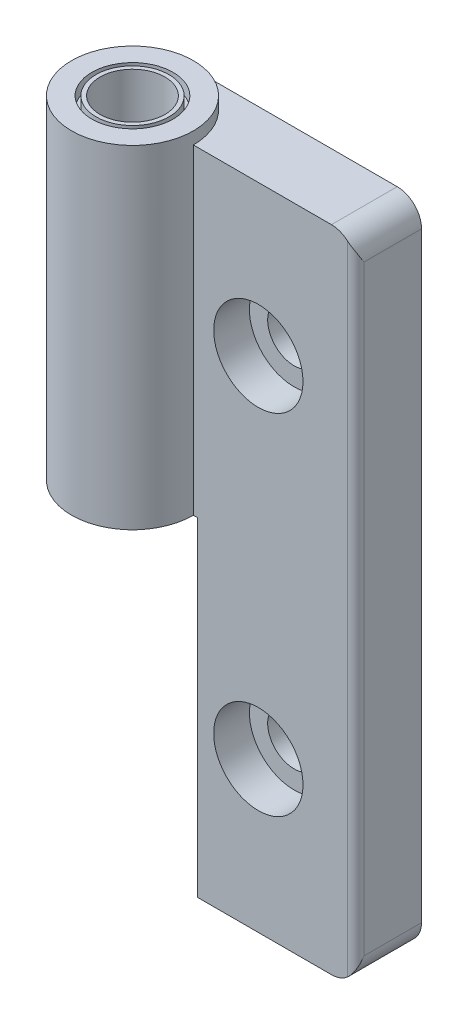
ISO-10303-21;
HEADER;
FILE_DESCRIPTION(('STEP AP214'),'2;1');
FILE_NAME('part.step','',(''),(''),'','','');
FILE_SCHEMA(('AUTOMOTIVE_DESIGN { 1 0 10303 214 1 1 1 1 }'));
ENDSEC;
DATA;
#1=APPLICATION_CONTEXT('core data for automotive mechanical design processes');
#2=APPLICATION_PROTOCOL_DEFINITION('international standard','automotive_design',2000,#1);
#3=PRODUCT_CONTEXT('',#1,'mechanical');
#4=PRODUCT('Part','Part','',(#3));
#5=PRODUCT_RELATED_PRODUCT_CATEGORY('part','',(#4));
#6=PRODUCT_DEFINITION_FORMATION('','',#4);
#7=PRODUCT_DEFINITION_CONTEXT('part definition',#1,'design');
#8=PRODUCT_DEFINITION('design','',#6,#7);
#9=PRODUCT_DEFINITION_SHAPE('','',#8);
#10=(LENGTH_UNIT() NAMED_UNIT(*) SI_UNIT(.MILLI.,.METRE.));
#11=(NAMED_UNIT(*) PLANE_ANGLE_UNIT() SI_UNIT($,.RADIAN.));
#12=(NAMED_UNIT(*) SI_UNIT($,.STERADIAN.) SOLID_ANGLE_UNIT());
#13=UNCERTAINTY_MEASURE_WITH_UNIT(LENGTH_MEASURE(1.E-05),#10,'distance_accuracy_value','');
#14=(GEOMETRIC_REPRESENTATION_CONTEXT(3) GLOBAL_UNCERTAINTY_ASSIGNED_CONTEXT((#13)) GLOBAL_UNIT_ASSIGNED_CONTEXT((#10,
#11,#12)) REPRESENTATION_CONTEXT('',''));
#15=CARTESIAN_POINT('',(0.,0.,0.));
#16=DIRECTION('',(0.,0.,1.));
#17=DIRECTION('',(1.,0.,0.));
#18=AXIS2_PLACEMENT_3D('',#15,#16,#17);
#19=CARTESIAN_POINT('',(0.,0.499999999999994,0.));
#20=DIRECTION('',(0.,1.,0.));
#21=DIRECTION('',(0.,0.,1.));
#22=AXIS2_PLACEMENT_3D('',#19,#20,#21);
#23=PLANE('',#22);
#24=CARTESIAN_POINT('',(0.,0.499999999999994,0.));
#25=DIRECTION('',(0.,1.,0.));
#26=DIRECTION('',(0.,0.,1.));
#27=AXIS2_PLACEMENT_3D('',#24,#25,#26);
#28=CIRCLE('',#27,3.99999999999998);
#29=CARTESIAN_POINT('',(0.,0.499999999999994,3.99999999999998));
#30=VERTEX_POINT('',#29);
#31=EDGE_CURVE('E371',#30,#30,#28,.T.);
#32=ORIENTED_EDGE('',*,*,#31,.T.);
#33=EDGE_LOOP('',(#32));
#34=FACE_BOUND('',#33,.T.);
#35=DIRECTION('',(0.,0.,-1.));
#36=VECTOR('',#35,1.);
#37=CARTESIAN_POINT('',(8.,0.499999999999994,-8.1));
#38=LINE('',#37,#36);
#39=CARTESIAN_POINT('',(8.,0.499999999999994,0.));
#40=VERTEX_POINT('',#39);
#41=CARTESIAN_POINT('',(8.,0.499999999999994,-8.1));
#42=VERTEX_POINT('',#41);
#43=EDGE_CURVE('E143',#40,#42,#38,.T.);
#44=ORIENTED_EDGE('',*,*,#43,.F.);
#45=DIRECTION('',(1.,0.,0.));
#46=VECTOR('',#45,1.);
#47=CARTESIAN_POINT('',(7.5,0.499999999999994,0.));
#48=LINE('',#47,#46);
#49=CARTESIAN_POINT('',(7.5,0.499999999999994,0.));
#50=VERTEX_POINT('',#49);
#51=EDGE_CURVE('E266',#50,#40,#48,.T.);
#52=ORIENTED_EDGE('',*,*,#51,.F.);
#53=CARTESIAN_POINT('',(0.,0.499999999999994,0.));
#54=DIRECTION('',(0.,1.,0.));
#55=DIRECTION('',(0.,0.,1.));
#56=AXIS2_PLACEMENT_3D('',#53,#54,#55);
#57=CIRCLE('',#56,7.5);
#58=CARTESIAN_POINT('',(2.,0.499999999999994,-7.22841614740048));
#59=VERTEX_POINT('',#58);
#60=EDGE_CURVE('E131',#59,#50,#57,.T.);
#61=ORIENTED_EDGE('',*,*,#60,.F.);
#62=DIRECTION('',(0.,0.,1.));
#63=VECTOR('',#62,1.);
#64=CARTESIAN_POINT('',(2.,0.499999999999994,-8.1));
#65=LINE('',#64,#63);
#66=CARTESIAN_POINT('',(2.,0.499999999999994,-8.1));
#67=VERTEX_POINT('',#66);
#68=EDGE_CURVE('E270',#67,#59,#65,.T.);
#69=ORIENTED_EDGE('',*,*,#68,.F.);
#70=DIRECTION('',(-1.,0.,0.));
#71=VECTOR('',#70,1.);
#72=CARTESIAN_POINT('',(27.5,0.499999999999994,-8.1));
#73=LINE('',#72,#71);
#74=EDGE_CURVE('E122',#42,#67,#73,.T.);
#75=ORIENTED_EDGE('',*,*,#74,.F.);
#76=EDGE_LOOP('',(#44,#52,#61,#69,#75));
#77=FACE_BOUND('',#76,.T.);
#78=ADVANCED_FACE('F32',(#34,#77),#23,.F.);
#79=CARTESIAN_POINT('',(27.5,0.499999999999994,0.));
#80=DIRECTION('',(1.,0.,0.));
#81=DIRECTION('',(0.,0.,-1.));
#82=AXIS2_PLACEMENT_3D('',#79,#80,#81);
#83=PLANE('',#82);
#84=DIRECTION('',(0.,1.,0.));
#85=VECTOR('',#84,1.);
#86=CARTESIAN_POINT('',(27.5,0.499999999999994,-8.1));
#87=LINE('',#86,#85);
#88=CARTESIAN_POINT('',(27.5,-37.,-8.1));
#89=VERTEX_POINT('',#88);
#90=CARTESIAN_POINT('',(27.5,37.,-8.1));
#91=VERTEX_POINT('',#90);
#92=EDGE_CURVE('E264',#89,#91,#87,.T.);
#93=ORIENTED_EDGE('',*,*,#92,.T.);
#94=DIRECTION('',(0.,0.,-1.));
#95=VECTOR('',#94,1.);
#96=CARTESIAN_POINT('',(27.5,37.,0.));
#97=LINE('',#96,#95);
#98=CARTESIAN_POINT('',(27.5,37.,-1.));
#99=VERTEX_POINT('',#98);
#100=EDGE_CURVE('E191',#91,#99,#97,.F.);
#101=ORIENTED_EDGE('',*,*,#100,.T.);
#102=DIRECTION('',(0.,1.,0.));
#103=VECTOR('',#102,1.);
#104=CARTESIAN_POINT('',(27.5,0.499999999999994,-1.));
#105=LINE('',#104,#103);
#106=CARTESIAN_POINT('',(27.5,-37.,-1.));
#107=VERTEX_POINT('',#106);
#108=EDGE_CURVE('E180',#99,#107,#105,.F.);
#109=ORIENTED_EDGE('',*,*,#108,.T.);
#110=DIRECTION('',(0.,0.,1.));
#111=VECTOR('',#110,1.);
#112=CARTESIAN_POINT('',(27.5,-37.,-8.1));
#113=LINE('',#112,#111);
#114=EDGE_CURVE('E189',#107,#89,#113,.F.);
#115=ORIENTED_EDGE('',*,*,#114,.T.);
#116=EDGE_LOOP('',(#93,#101,#109,#115));
#117=FACE_BOUND('',#116,.T.);
#118=ADVANCED_FACE('F209',(#117),#83,.T.);
#119=CARTESIAN_POINT('',(7.5,0.499999999999994,0.));
#120=DIRECTION('',(0.,0.,1.));
#121=DIRECTION('',(1.,0.,0.));
#122=AXIS2_PLACEMENT_3D('',#119,#120,#121);
#123=PLANE('',#122);
#124=CARTESIAN_POINT('',(15.5,21.5,0.));
#125=DIRECTION('',(0.,0.,1.));
#126=DIRECTION('',(1.,0.,0.));
#127=AXIS2_PLACEMENT_3D('',#124,#125,#126);
#128=CIRCLE('',#127,5.49999999999999);
#129=CARTESIAN_POINT('',(21.,21.5,0.));
#130=VERTEX_POINT('',#129);
#131=EDGE_CURVE('E356',#130,#130,#128,.T.);
#132=ORIENTED_EDGE('',*,*,#131,.F.);
#133=EDGE_LOOP('',(#132));
#134=FACE_BOUND('',#133,.T.);
#135=CARTESIAN_POINT('',(15.5,-21.5,0.));
#136=DIRECTION('',(0.,0.,1.));
#137=DIRECTION('',(1.,0.,0.));
#138=AXIS2_PLACEMENT_3D('',#135,#136,#137);
#139=CIRCLE('',#138,5.49999999999999);
#140=CARTESIAN_POINT('',(21.,-21.5,0.));
#141=VERTEX_POINT('',#140);
#142=EDGE_CURVE('E177',#141,#141,#139,.T.);
#143=ORIENTED_EDGE('',*,*,#142,.F.);
#144=EDGE_LOOP('',(#143));
#145=FACE_BOUND('',#144,.T.);
#146=DIRECTION('',(0.,1.,0.));
#147=VECTOR('',#146,1.);
#148=CARTESIAN_POINT('',(26.5,0.499999999999994,0.));
#149=LINE('',#148,#147);
#150=CARTESIAN_POINT('',(26.5,-39.2360679774998,0.));
#151=VERTEX_POINT('',#150);
#152=CARTESIAN_POINT('',(26.5,39.2360679774998,0.));
#153=VERTEX_POINT('',#152);
#154=EDGE_CURVE('E133',#151,#153,#149,.T.);
#155=ORIENTED_EDGE('',*,*,#154,.T.);
#156=CARTESIAN_POINT('',(24.5,37.,0.));
#157=DIRECTION('',(0.,0.,1.));
#158=DIRECTION('',(1.,0.,0.));
#159=AXIS2_PLACEMENT_3D('',#156,#157,#158);
#160=CIRCLE('',#159,2.99999999999999);
#161=CARTESIAN_POINT('',(24.5,40.,0.));
#162=VERTEX_POINT('',#161);
#163=EDGE_CURVE('E41',#153,#162,#160,.T.);
#164=ORIENTED_EDGE('',*,*,#163,.T.);
#165=DIRECTION('',(1.,0.,0.));
#166=VECTOR('',#165,1.);
#167=CARTESIAN_POINT('',(7.5,40.,0.));
#168=LINE('',#167,#166);
#169=CARTESIAN_POINT('',(7.5,40.,0.));
#170=VERTEX_POINT('',#169);
#171=EDGE_CURVE('E111',#170,#162,#168,.T.);
#172=ORIENTED_EDGE('',*,*,#171,.F.);
#173=DIRECTION('',(0.,1.,0.));
#174=VECTOR('',#173,1.);
#175=CARTESIAN_POINT('',(7.5,0.499999999999994,0.));
#176=LINE('',#175,#174);
#177=EDGE_CURVE('E115',#50,#170,#176,.T.);
#178=ORIENTED_EDGE('',*,*,#177,.F.);
#179=ORIENTED_EDGE('',*,*,#51,.T.);
#180=DIRECTION('',(0.,1.,0.));
#181=VECTOR('',#180,1.);
#182=CARTESIAN_POINT('',(8.,-40.,0.));
#183=LINE('',#182,#181);
#184=CARTESIAN_POINT('',(8.,-40.,0.));
#185=VERTEX_POINT('',#184);
#186=EDGE_CURVE('E255',#185,#40,#183,.T.);
#187=ORIENTED_EDGE('',*,*,#186,.F.);
#188=DIRECTION('',(-1.,0.,0.));
#189=VECTOR('',#188,1.);
#190=CARTESIAN_POINT('',(8.,-40.,0.));
#191=LINE('',#190,#189);
#192=CARTESIAN_POINT('',(24.5,-40.,0.));
#193=VERTEX_POINT('',#192);
#194=EDGE_CURVE('E150',#193,#185,#191,.T.);
#195=ORIENTED_EDGE('',*,*,#194,.F.);
#196=CARTESIAN_POINT('',(24.5,-37.,0.));
#197=DIRECTION('',(0.,0.,1.));
#198=DIRECTION('',(1.,0.,0.));
#199=AXIS2_PLACEMENT_3D('',#196,#197,#198);
#200=CIRCLE('',#199,2.99999999999999);
#201=EDGE_CURVE('E48',#193,#151,#200,.T.);
#202=ORIENTED_EDGE('',*,*,#201,.T.);
#203=EDGE_LOOP('',(#155,#164,#172,#178,#179,#187,#195,#202));
#204=FACE_BOUND('',#203,.T.);
#205=ADVANCED_FACE('F113',(#134,#145,#204),#123,.T.);
#206=CARTESIAN_POINT('',(0.,0.499999999999994,0.));
#207=DIRECTION('',(0.,1.,0.));
#208=DIRECTION('',(0.,0.,1.));
#209=AXIS2_PLACEMENT_3D('',#206,#207,#208);
#210=CYLINDRICAL_SURFACE('',#209,7.5);
#211=ORIENTED_EDGE('',*,*,#177,.T.);
#212=CARTESIAN_POINT('',(0.,40.,0.));
#213=DIRECTION('',(0.,1.,0.));
#214=DIRECTION('',(0.,0.,1.));
#215=AXIS2_PLACEMENT_3D('',#212,#213,#214);
#216=CIRCLE('',#215,7.5);
#217=CARTESIAN_POINT('',(2.,40.,-7.22841614740048));
#218=VERTEX_POINT('',#217);
#219=EDGE_CURVE('E129',#170,#218,#216,.T.);
#220=ORIENTED_EDGE('',*,*,#219,.T.);
#221=DIRECTION('',(0.,1.,0.));
#222=VECTOR('',#221,1.);
#223=CARTESIAN_POINT('',(2.,0.499999999999994,-7.22841614740048));
#224=LINE('',#223,#222);
#225=EDGE_CURVE('E134',#59,#218,#224,.T.);
#226=ORIENTED_EDGE('',*,*,#225,.F.);
#227=ORIENTED_EDGE('',*,*,#60,.T.);
#228=EDGE_LOOP('',(#211,#220,#226,#227));
#229=FACE_BOUND('',#228,.T.);
#230=CARTESIAN_POINT('',(0.,41.5,0.));
#231=DIRECTION('',(0.,1.,0.));
#232=DIRECTION('',(0.,0.,1.));
#233=AXIS2_PLACEMENT_3D('',#230,#231,#232);
#234=CIRCLE('',#233,7.5);
#235=CARTESIAN_POINT('',(0.,41.5,7.5));
#236=VERTEX_POINT('',#235);
#237=EDGE_CURVE('E139',#236,#236,#234,.T.);
#238=ORIENTED_EDGE('',*,*,#237,.F.);
#239=EDGE_LOOP('',(#238));
#240=FACE_BOUND('',#239,.T.);
#241=ADVANCED_FACE('F127',(#229,#240),#210,.T.);
#242=CARTESIAN_POINT('',(2.,0.499999999999994,-8.1));
#243=DIRECTION('',(-1.,0.,0.));
#244=DIRECTION('',(0.,0.,1.));
#245=AXIS2_PLACEMENT_3D('',#242,#243,#244);
#246=PLANE('',#245);
#247=DIRECTION('',(0.,0.,1.));
#248=VECTOR('',#247,1.);
#249=CARTESIAN_POINT('',(2.,40.,-8.1));
#250=LINE('',#249,#248);
#251=CARTESIAN_POINT('',(2.,40.,-8.1));
#252=VERTEX_POINT('',#251);
#253=EDGE_CURVE('E123',#252,#218,#250,.T.);
#254=ORIENTED_EDGE('',*,*,#253,.F.);
#255=DIRECTION('',(0.,1.,0.));
#256=VECTOR('',#255,1.);
#257=CARTESIAN_POINT('',(2.,0.499999999999994,-8.1));
#258=LINE('',#257,#256);
#259=EDGE_CURVE('E162',#67,#252,#258,.T.);
#260=ORIENTED_EDGE('',*,*,#259,.F.);
#261=ORIENTED_EDGE('',*,*,#68,.T.);
#262=ORIENTED_EDGE('',*,*,#225,.T.);
#263=EDGE_LOOP('',(#254,#260,#261,#262));
#264=FACE_BOUND('',#263,.T.);
#265=ADVANCED_FACE('F239',(#264),#246,.T.);
#266=CARTESIAN_POINT('',(27.5,0.499999999999994,-8.1));
#267=DIRECTION('',(0.,0.,-1.));
#268=DIRECTION('',(-1.,0.,0.));
#269=AXIS2_PLACEMENT_3D('',#266,#267,#268);
#270=PLANE('',#269);
#271=CARTESIAN_POINT('',(15.5,21.5,-8.1));
#272=DIRECTION('',(0.,0.,-1.));
#273=DIRECTION('',(-1.,0.,0.));
#274=AXIS2_PLACEMENT_3D('',#271,#272,#273);
#275=CIRCLE('',#274,3.25000000000001);
#276=CARTESIAN_POINT('',(12.25,21.5,-8.1));
#277=VERTEX_POINT('',#276);
#278=EDGE_CURVE('E174',#277,#277,#275,.T.);
#279=ORIENTED_EDGE('',*,*,#278,.F.);
#280=EDGE_LOOP('',(#279));
#281=FACE_BOUND('',#280,.T.);
#282=CARTESIAN_POINT('',(15.5,-21.5,-8.1));
#283=DIRECTION('',(0.,0.,-1.));
#284=DIRECTION('',(-1.,0.,0.));
#285=AXIS2_PLACEMENT_3D('',#282,#283,#284);
#286=CIRCLE('',#285,3.25000000000001);
#287=CARTESIAN_POINT('',(12.25,-21.5,-8.1));
#288=VERTEX_POINT('',#287);
#289=EDGE_CURVE('E169',#288,#288,#286,.T.);
#290=ORIENTED_EDGE('',*,*,#289,.F.);
#291=EDGE_LOOP('',(#290));
#292=FACE_BOUND('',#291,.T.);
#293=DIRECTION('',(-1.,0.,0.));
#294=VECTOR('',#293,1.);
#295=CARTESIAN_POINT('',(27.5,40.,-8.1));
#296=LINE('',#295,#294);
#297=CARTESIAN_POINT('',(24.5,40.,-8.1));
#298=VERTEX_POINT('',#297);
#299=EDGE_CURVE('E166',#298,#252,#296,.T.);
#300=ORIENTED_EDGE('',*,*,#299,.F.);
#301=CARTESIAN_POINT('',(24.5,37.,-8.1));
#302=DIRECTION('',(0.,0.,-1.));
#303=DIRECTION('',(-1.,0.,0.));
#304=AXIS2_PLACEMENT_3D('',#301,#302,#303);
#305=CIRCLE('',#304,2.99999999999999);
#306=EDGE_CURVE('E187',#298,#91,#305,.T.);
#307=ORIENTED_EDGE('',*,*,#306,.T.);
#308=ORIENTED_EDGE('',*,*,#92,.F.);
#309=CARTESIAN_POINT('',(24.5,-37.,-8.1));
#310=DIRECTION('',(0.,0.,-1.));
#311=DIRECTION('',(-1.,0.,0.));
#312=AXIS2_PLACEMENT_3D('',#309,#310,#311);
#313=CIRCLE('',#312,2.99999999999999);
#314=CARTESIAN_POINT('',(24.5,-40.,-8.1));
#315=VERTEX_POINT('',#314);
#316=EDGE_CURVE('E185',#89,#315,#313,.T.);
#317=ORIENTED_EDGE('',*,*,#316,.T.);
#318=DIRECTION('',(1.,0.,0.));
#319=VECTOR('',#318,1.);
#320=CARTESIAN_POINT('',(27.5,-40.,-8.1));
#321=LINE('',#320,#319);
#322=CARTESIAN_POINT('',(8.,-40.,-8.1));
#323=VERTEX_POINT('',#322);
#324=EDGE_CURVE('E290',#323,#315,#321,.T.);
#325=ORIENTED_EDGE('',*,*,#324,.F.);
#326=DIRECTION('',(0.,1.,0.));
#327=VECTOR('',#326,1.);
#328=CARTESIAN_POINT('',(8.,-40.,-8.1));
#329=LINE('',#328,#327);
#330=EDGE_CURVE('E258',#323,#42,#329,.T.);
#331=ORIENTED_EDGE('',*,*,#330,.T.);
#332=ORIENTED_EDGE('',*,*,#74,.T.);
#333=ORIENTED_EDGE('',*,*,#259,.T.);
#334=EDGE_LOOP('',(#300,#307,#308,#317,#325,#331,#332,#333));
#335=FACE_BOUND('',#334,.T.);
#336=ADVANCED_FACE('F233',(#281,#292,#335),#270,.T.);
#337=CARTESIAN_POINT('',(0.,40.,0.));
#338=DIRECTION('',(0.,1.,0.));
#339=DIRECTION('',(0.,0.,1.));
#340=AXIS2_PLACEMENT_3D('',#337,#338,#339);
#341=PLANE('',#340);
#342=ORIENTED_EDGE('',*,*,#171,.T.);
#343=DIRECTION('',(0.,0.,-1.));
#344=VECTOR('',#343,1.);
#345=CARTESIAN_POINT('',(24.5,40.,0.));
#346=LINE('',#345,#344);
#347=EDGE_CURVE('E183',#162,#298,#346,.T.);
#348=ORIENTED_EDGE('',*,*,#347,.T.);
#349=ORIENTED_EDGE('',*,*,#299,.T.);
#350=ORIENTED_EDGE('',*,*,#253,.T.);
#351=ORIENTED_EDGE('',*,*,#219,.F.);
#352=EDGE_LOOP('',(#342,#348,#349,#350,#351));
#353=FACE_BOUND('',#352,.T.);
#354=ADVANCED_FACE('F137',(#353),#341,.T.);
#355=CARTESIAN_POINT('',(8.,-40.,-8.1));
#356=DIRECTION('',(1.,0.,0.));
#357=DIRECTION('',(0.,0.,-1.));
#358=AXIS2_PLACEMENT_3D('',#355,#356,#357);
#359=PLANE('',#358);
#360=ORIENTED_EDGE('',*,*,#43,.T.);
#361=ORIENTED_EDGE('',*,*,#330,.F.);
#362=DIRECTION('',(0.,0.,-1.));
#363=VECTOR('',#362,1.);
#364=CARTESIAN_POINT('',(8.,-40.,-8.1));
#365=LINE('',#364,#363);
#366=EDGE_CURVE('E286',#185,#323,#365,.T.);
#367=ORIENTED_EDGE('',*,*,#366,.F.);
#368=ORIENTED_EDGE('',*,*,#186,.T.);
#369=EDGE_LOOP('',(#360,#361,#367,#368));
#370=FACE_BOUND('',#369,.T.);
#371=ADVANCED_FACE('F229',(#370),#359,.F.);
#372=CARTESIAN_POINT('',(0.,-40.,0.));
#373=DIRECTION('',(0.,1.,0.));
#374=DIRECTION('',(0.,0.,1.));
#375=AXIS2_PLACEMENT_3D('',#372,#373,#374);
#376=PLANE('',#375);
#377=ORIENTED_EDGE('',*,*,#324,.T.);
#378=DIRECTION('',(0.,0.,1.));
#379=VECTOR('',#378,1.);
#380=CARTESIAN_POINT('',(24.5,-40.,-1.));
#381=LINE('',#380,#379);
#382=EDGE_CURVE('E11',#315,#193,#381,.T.);
#383=ORIENTED_EDGE('',*,*,#382,.T.);
#384=ORIENTED_EDGE('',*,*,#194,.T.);
#385=ORIENTED_EDGE('',*,*,#366,.T.);
#386=EDGE_LOOP('',(#377,#383,#384,#385));
#387=FACE_BOUND('',#386,.T.);
#388=ADVANCED_FACE('F291',(#387),#376,.F.);
#389=CARTESIAN_POINT('',(0.,41.5,0.));
#390=DIRECTION('',(0.,1.,0.));
#391=DIRECTION('',(0.,0.,1.));
#392=AXIS2_PLACEMENT_3D('',#389,#390,#391);
#393=PLANE('',#392);
#394=CARTESIAN_POINT('',(0.,41.5,0.));
#395=DIRECTION('',(0.,1.,0.));
#396=DIRECTION('',(0.,0.,1.));
#397=AXIS2_PLACEMENT_3D('',#394,#395,#396);
#398=CIRCLE('',#397,4.99999999999999);
#399=CARTESIAN_POINT('',(0.,41.5,4.99999999999999));
#400=VERTEX_POINT('',#399);
#401=EDGE_CURVE('E146',#400,#400,#398,.T.);
#402=ORIENTED_EDGE('',*,*,#401,.F.);
#403=EDGE_LOOP('',(#402));
#404=FACE_BOUND('',#403,.T.);
#405=ORIENTED_EDGE('',*,*,#237,.T.);
#406=EDGE_LOOP('',(#405));
#407=FACE_BOUND('',#406,.T.);
#408=ADVANCED_FACE('F298',(#404,#407),#393,.T.);
#409=CARTESIAN_POINT('',(0.,40.,0.));
#410=DIRECTION('',(0.,-1.,0.));
#411=DIRECTION('',(0.,0.,-1.));
#412=AXIS2_PLACEMENT_3D('',#409,#410,#411);
#413=PLANE('',#412);
#414=CARTESIAN_POINT('',(0.,40.,0.));
#415=DIRECTION('',(0.,1.,0.));
#416=DIRECTION('',(0.,0.,1.));
#417=AXIS2_PLACEMENT_3D('',#414,#415,#416);
#418=CIRCLE('',#417,4.5);
#419=CARTESIAN_POINT('',(0.,40.,4.5));
#420=VERTEX_POINT('',#419);
#421=EDGE_CURVE('E376',#420,#420,#418,.T.);
#422=ORIENTED_EDGE('',*,*,#421,.F.);
#423=EDGE_LOOP('',(#422));
#424=FACE_BOUND('',#423,.T.);
#425=CARTESIAN_POINT('',(0.,40.,0.));
#426=DIRECTION('',(0.,1.,0.));
#427=DIRECTION('',(0.,0.,1.));
#428=AXIS2_PLACEMENT_3D('',#425,#426,#427);
#429=CIRCLE('',#428,4.99999999999999);
#430=CARTESIAN_POINT('',(0.,40.,4.99999999999999));
#431=VERTEX_POINT('',#430);
#432=EDGE_CURVE('E140',#431,#431,#429,.T.);
#433=ORIENTED_EDGE('',*,*,#432,.T.);
#434=EDGE_LOOP('',(#433));
#435=FACE_BOUND('',#434,.T.);
#436=ADVANCED_FACE('F303',(#424,#435),#413,.F.);
#437=CARTESIAN_POINT('',(0.,41.5,0.));
#438=DIRECTION('',(0.,1.,0.));
#439=DIRECTION('',(0.,0.,1.));
#440=AXIS2_PLACEMENT_3D('',#437,#438,#439);
#441=CYLINDRICAL_SURFACE('',#440,4.99999999999999);
#442=ORIENTED_EDGE('',*,*,#432,.F.);
#443=EDGE_LOOP('',(#442));
#444=FACE_BOUND('',#443,.T.);
#445=ORIENTED_EDGE('',*,*,#401,.T.);
#446=EDGE_LOOP('',(#445));
#447=FACE_BOUND('',#446,.T.);
#448=ADVANCED_FACE('F309',(#444,#447),#441,.F.);
#449=CARTESIAN_POINT('',(0.,40.,0.));
#450=DIRECTION('',(0.,1.,0.));
#451=DIRECTION('',(0.,0.,1.));
#452=AXIS2_PLACEMENT_3D('',#449,#450,#451);
#453=CYLINDRICAL_SURFACE('',#452,4.5);
#454=ORIENTED_EDGE('',*,*,#421,.T.);
#455=EDGE_LOOP('',(#454));
#456=FACE_BOUND('',#455,.T.);
#457=CARTESIAN_POINT('',(0.,41.5,0.));
#458=DIRECTION('',(0.,1.,0.));
#459=DIRECTION('',(0.,0.,1.));
#460=AXIS2_PLACEMENT_3D('',#457,#458,#459);
#461=CIRCLE('',#460,4.5);
#462=CARTESIAN_POINT('',(0.,41.5,4.5));
#463=VERTEX_POINT('',#462);
#464=EDGE_CURVE('E373',#463,#463,#461,.T.);
#465=ORIENTED_EDGE('',*,*,#464,.F.);
#466=EDGE_LOOP('',(#465));
#467=FACE_BOUND('',#466,.T.);
#468=ADVANCED_FACE('F313',(#456,#467),#453,.T.);
#469=CARTESIAN_POINT('',(0.,41.5,0.));
#470=DIRECTION('',(0.,1.,0.));
#471=DIRECTION('',(0.,0.,1.));
#472=AXIS2_PLACEMENT_3D('',#469,#470,#471);
#473=PLANE('',#472);
#474=CARTESIAN_POINT('',(0.,41.5,0.));
#475=DIRECTION('',(0.,1.,0.));
#476=DIRECTION('',(0.,0.,1.));
#477=AXIS2_PLACEMENT_3D('',#474,#475,#476);
#478=CIRCLE('',#477,3.99999999999999);
#479=CARTESIAN_POINT('',(0.,41.5,3.99999999999999));
#480=VERTEX_POINT('',#479);
#481=EDGE_CURVE('E172',#480,#480,#478,.T.);
#482=ORIENTED_EDGE('',*,*,#481,.F.);
#483=EDGE_LOOP('',(#482));
#484=FACE_BOUND('',#483,.T.);
#485=ORIENTED_EDGE('',*,*,#464,.T.);
#486=EDGE_LOOP('',(#485));
#487=FACE_BOUND('',#486,.T.);
#488=ADVANCED_FACE('F317',(#484,#487),#473,.T.);
#489=CARTESIAN_POINT('',(0.,41.5,0.));
#490=DIRECTION('',(0.,1.,0.));
#491=DIRECTION('',(0.,0.,1.));
#492=AXIS2_PLACEMENT_3D('',#489,#490,#491);
#493=CYLINDRICAL_SURFACE('',#492,3.99999999999998);
#494=ORIENTED_EDGE('',*,*,#481,.T.);
#495=EDGE_LOOP('',(#494));
#496=FACE_BOUND('',#495,.T.);
#497=ORIENTED_EDGE('',*,*,#31,.F.);
#498=EDGE_LOOP('',(#497));
#499=FACE_BOUND('',#498,.T.);
#500=ADVANCED_FACE('F321',(#496,#499),#493,.F.);
#501=CARTESIAN_POINT('',(15.5,-21.5,0.));
#502=DIRECTION('',(0.,0.,1.));
#503=DIRECTION('',(1.,0.,0.));
#504=AXIS2_PLACEMENT_3D('',#501,#502,#503);
#505=CYLINDRICAL_SURFACE('',#504,3.25000000000001);
#506=ORIENTED_EDGE('',*,*,#289,.T.);
#507=EDGE_LOOP('',(#506));
#508=FACE_BOUND('',#507,.T.);
#509=CARTESIAN_POINT('',(15.5,-21.5,-4.4));
#510=DIRECTION('',(0.,0.,1.));
#511=DIRECTION('',(1.,0.,0.));
#512=AXIS2_PLACEMENT_3D('',#509,#510,#511);
#513=CIRCLE('',#512,3.25000000000001);
#514=CARTESIAN_POINT('',(18.75,-21.5,-4.4));
#515=VERTEX_POINT('',#514);
#516=EDGE_CURVE('E173',#515,#515,#513,.T.);
#517=ORIENTED_EDGE('',*,*,#516,.T.);
#518=EDGE_LOOP('',(#517));
#519=FACE_BOUND('',#518,.T.);
#520=ADVANCED_FACE('F325',(#508,#519),#505,.F.);
#521=CARTESIAN_POINT('',(18.75,-21.5,-4.4));
#522=DIRECTION('',(0.,0.,-1.));
#523=DIRECTION('',(-1.,0.,0.));
#524=AXIS2_PLACEMENT_3D('',#521,#522,#523);
#525=PLANE('',#524);
#526=ORIENTED_EDGE('',*,*,#516,.F.);
#527=EDGE_LOOP('',(#526));
#528=FACE_BOUND('',#527,.T.);
#529=CARTESIAN_POINT('',(15.5,-21.5,-4.4));
#530=DIRECTION('',(0.,0.,1.));
#531=DIRECTION('',(1.,0.,0.));
#532=AXIS2_PLACEMENT_3D('',#529,#530,#531);
#533=CIRCLE('',#532,5.49999999999999);
#534=CARTESIAN_POINT('',(21.,-21.5,-4.4));
#535=VERTEX_POINT('',#534);
#536=EDGE_CURVE('E364',#535,#535,#533,.T.);
#537=ORIENTED_EDGE('',*,*,#536,.T.);
#538=EDGE_LOOP('',(#537));
#539=FACE_BOUND('',#538,.T.);
#540=ADVANCED_FACE('F329',(#528,#539),#525,.F.);
#541=CARTESIAN_POINT('',(15.5,-21.5,0.));
#542=DIRECTION('',(0.,0.,1.));
#543=DIRECTION('',(1.,0.,0.));
#544=AXIS2_PLACEMENT_3D('',#541,#542,#543);
#545=CYLINDRICAL_SURFACE('',#544,5.49999999999999);
#546=ORIENTED_EDGE('',*,*,#536,.F.);
#547=EDGE_LOOP('',(#546));
#548=FACE_BOUND('',#547,.T.);
#549=ORIENTED_EDGE('',*,*,#142,.T.);
#550=EDGE_LOOP('',(#549));
#551=FACE_BOUND('',#550,.T.);
#552=ADVANCED_FACE('F333',(#548,#551),#545,.F.);
#553=CARTESIAN_POINT('',(15.5,21.5,0.));
#554=DIRECTION('',(0.,0.,1.));
#555=DIRECTION('',(1.,0.,0.));
#556=AXIS2_PLACEMENT_3D('',#553,#554,#555);
#557=CYLINDRICAL_SURFACE('',#556,3.25000000000001);
#558=ORIENTED_EDGE('',*,*,#278,.T.);
#559=EDGE_LOOP('',(#558));
#560=FACE_BOUND('',#559,.T.);
#561=CARTESIAN_POINT('',(15.5,21.5,-4.4));
#562=DIRECTION('',(0.,0.,1.));
#563=DIRECTION('',(1.,0.,0.));
#564=AXIS2_PLACEMENT_3D('',#561,#562,#563);
#565=CIRCLE('',#564,3.25000000000001);
#566=CARTESIAN_POINT('',(18.75,21.5,-4.4));
#567=VERTEX_POINT('',#566);
#568=EDGE_CURVE('E178',#567,#567,#565,.T.);
#569=ORIENTED_EDGE('',*,*,#568,.T.);
#570=EDGE_LOOP('',(#569));
#571=FACE_BOUND('',#570,.T.);
#572=ADVANCED_FACE('F337',(#560,#571),#557,.F.);
#573=CARTESIAN_POINT('',(18.75,21.5,-4.4));
#574=DIRECTION('',(0.,0.,-1.));
#575=DIRECTION('',(-1.,0.,0.));
#576=AXIS2_PLACEMENT_3D('',#573,#574,#575);
#577=PLANE('',#576);
#578=ORIENTED_EDGE('',*,*,#568,.F.);
#579=EDGE_LOOP('',(#578));
#580=FACE_BOUND('',#579,.T.);
#581=CARTESIAN_POINT('',(15.5,21.5,-4.4));
#582=DIRECTION('',(0.,0.,1.));
#583=DIRECTION('',(1.,0.,0.));
#584=AXIS2_PLACEMENT_3D('',#581,#582,#583);
#585=CIRCLE('',#584,5.49999999999999);
#586=CARTESIAN_POINT('',(21.,21.5,-4.4));
#587=VERTEX_POINT('',#586);
#588=EDGE_CURVE('E353',#587,#587,#585,.T.);
#589=ORIENTED_EDGE('',*,*,#588,.T.);
#590=EDGE_LOOP('',(#589));
#591=FACE_BOUND('',#590,.T.);
#592=ADVANCED_FACE('F341',(#580,#591),#577,.F.);
#593=CARTESIAN_POINT('',(15.5,21.5,0.));
#594=DIRECTION('',(0.,0.,1.));
#595=DIRECTION('',(1.,0.,0.));
#596=AXIS2_PLACEMENT_3D('',#593,#594,#595);
#597=CYLINDRICAL_SURFACE('',#596,5.49999999999999);
#598=ORIENTED_EDGE('',*,*,#588,.F.);
#599=EDGE_LOOP('',(#598));
#600=FACE_BOUND('',#599,.T.);
#601=ORIENTED_EDGE('',*,*,#131,.T.);
#602=EDGE_LOOP('',(#601));
#603=FACE_BOUND('',#602,.T.);
#604=ADVANCED_FACE('F208',(#600,#603),#597,.F.);
#605=CARTESIAN_POINT('',(26.5,0.499999999999994,-1.));
#606=DIRECTION('',(0.,1.,0.));
#607=DIRECTION('',(0.,0.,1.));
#608=AXIS2_PLACEMENT_3D('',#605,#606,#607);
#609=CYLINDRICAL_SURFACE('',#608,1.);
#610=ORIENTED_EDGE('',*,*,#108,.F.);
#611=CARTESIAN_POINT('',(26.5,39.2360679774998,0.));
#612=CARTESIAN_POINT('',(26.5316578772173,39.2077572937075,-4.55551072002007E-06));
#613=CARTESIAN_POINT('',(26.562687444377,39.1787885816354,-0.00150263052097015));
#614=CARTESIAN_POINT('',(26.6233321725058,39.1197274162069,-0.00716698518481857));
#615=CARTESIAN_POINT('',(26.652949081136,39.0896364379924,-0.0113298709753141));
#616=CARTESIAN_POINT('',(26.7391262742663,38.9983201473494,-0.0272642318094649));
#617=CARTESIAN_POINT('',(26.7934948471067,38.935618835025,-0.0424913092058037));
#618=CARTESIAN_POINT('',(26.9295613572291,38.7651445015374,-0.0924370178179932));
#619=CARTESIAN_POINT('',(27.0057446330972,38.6548259454961,-0.133388824712252));
#620=CARTESIAN_POINT('',(27.1412372779232,38.4287723628818,-0.228187305913893));
#621=CARTESIAN_POINT('',(27.2004379140891,38.3130077259145,-0.282113178334035));
#622=CARTESIAN_POINT('',(27.2876689239468,38.1122851667142,-0.381459073324638));
#623=CARTESIAN_POINT('',(27.319766680889,38.0280484674357,-0.424861251473698));
#624=CARTESIAN_POINT('',(27.3759320021477,37.8584871191474,-0.514664336115301));
#625=CARTESIAN_POINT('',(27.3999955148087,37.7731619436708,-0.56106674158047));
#626=CARTESIAN_POINT('',(27.460402907647,37.5165620419738,-0.703036580570087));
#627=CARTESIAN_POINT('',(27.4852102334562,37.3440816395095,-0.801666019614423));
#628=CARTESIAN_POINT('',(27.4981840462985,37.1175431072325,-0.932142301887712));
#629=CARTESIAN_POINT('',(27.4998141662827,37.0635187811286,-0.963327735185317));
#630=CARTESIAN_POINT('',(27.4999949980915,37.0063245855028,-0.996348494144039));
#631=CARTESIAN_POINT('',(27.4999999978197,37.0031623061903,-0.998174236846674));
#632=CARTESIAN_POINT('',(27.5,37.,-1.));
#633=B_SPLINE_CURVE_WITH_KNOTS('',3,(#611,#612,#613,#614,#615,#616,#617,#618,#619,#620,#621,
#622,#623,#624,#625,#626,#627,#628,#629,#630,#631,#632),.UNSPECIFIED.,.F.,.F.,(4,2,2,2,2,2,2,2,
2,2,4),(0.,0.127328124372215,0.25449440731463,0.506902758847992,0.925154347494123,
1.34602692875662,1.64578712718786,1.94569826663479,2.54344782717993,2.7306215879237,
2.7415760493441),.UNSPECIFIED.);
#634=EDGE_CURVE('E55',#99,#153,#633,.F.);
#635=ORIENTED_EDGE('',*,*,#634,.T.);
#636=ORIENTED_EDGE('',*,*,#154,.F.);
#637=CARTESIAN_POINT('',(26.5,-39.2360679774998,0.));
#638=CARTESIAN_POINT('',(26.5316578772173,-39.2077572937075,-4.55551071979498E-06));
#639=CARTESIAN_POINT('',(26.562687444377,-39.1787885816354,-0.00150263052096986));
#640=CARTESIAN_POINT('',(26.6233321725058,-39.1197274162069,-0.0071669851848181));
#641=CARTESIAN_POINT('',(26.652949081136,-39.0896364379924,-0.0113298709753134));
#642=CARTESIAN_POINT('',(26.7391262742663,-38.9983201473494,-0.027264231809464));
#643=CARTESIAN_POINT('',(26.7934948471067,-38.935618835025,-0.042491309205803));
#644=CARTESIAN_POINT('',(26.9295613572291,-38.7651445015374,-0.0924370178179931));
#645=CARTESIAN_POINT('',(27.0057446330972,-38.6548259454961,-0.133388824712252));
#646=CARTESIAN_POINT('',(27.1412372779232,-38.4287723628818,-0.228187305913893));
#647=CARTESIAN_POINT('',(27.2004379140891,-38.3130077259145,-0.282113178334035));
#648=CARTESIAN_POINT('',(27.2876689239468,-38.1122851667142,-0.381459073324637));
#649=CARTESIAN_POINT('',(27.319766680889,-38.0280484674357,-0.424861251473696));
#650=CARTESIAN_POINT('',(27.3759320021477,-37.8584871191475,-0.514664336115299));
#651=CARTESIAN_POINT('',(27.3999955148087,-37.7731619436708,-0.561066741580469));
#652=CARTESIAN_POINT('',(27.460402907647,-37.5165620419738,-0.703036580570087));
#653=CARTESIAN_POINT('',(27.4852102334562,-37.3440816395096,-0.801666019614423));
#654=CARTESIAN_POINT('',(27.4981840462985,-37.1175431072325,-0.932142301887712));
#655=CARTESIAN_POINT('',(27.4998141662827,-37.0635187811286,-0.963327735185317));
#656=CARTESIAN_POINT('',(27.4999949980915,-37.0063245855028,-0.996348494144039));
#657=CARTESIAN_POINT('',(27.4999999978197,-37.0031623061903,-0.998174236846674));
#658=CARTESIAN_POINT('',(27.5,-37.,-1.));
#659=B_SPLINE_CURVE_WITH_KNOTS('',3,(#637,#638,#639,#640,#641,#642,#643,#644,#645,#646,#647,
#648,#649,#650,#651,#652,#653,#654,#655,#656,#657,#658),.UNSPECIFIED.,.F.,.F.,(4,2,2,2,2,2,2,2,
2,2,4),(0.,0.127328124372213,0.25449440731462,0.506902758847992,0.925154347494123,
1.34602692875662,1.64578712718785,1.94569826663479,2.54344782717993,2.7306215879237,
2.7415760493441),.UNSPECIFIED.);
#660=EDGE_CURVE('E193',#151,#107,#659,.T.);
#661=ORIENTED_EDGE('',*,*,#660,.T.);
#662=EDGE_LOOP('',(#610,#635,#636,#661));
#663=FACE_BOUND('',#662,.T.);
#664=ADVANCED_FACE('F203',(#663),#609,.T.);
#665=CARTESIAN_POINT('',(24.5,37.,0.));
#666=DIRECTION('',(0.,0.,-1.));
#667=DIRECTION('',(-1.,0.,0.));
#668=AXIS2_PLACEMENT_3D('',#665,#666,#667);
#669=CYLINDRICAL_SURFACE('',#668,2.99999999999999);
#670=ORIENTED_EDGE('',*,*,#634,.F.);
#671=ORIENTED_EDGE('',*,*,#100,.F.);
#672=ORIENTED_EDGE('',*,*,#306,.F.);
#673=ORIENTED_EDGE('',*,*,#347,.F.);
#674=ORIENTED_EDGE('',*,*,#163,.F.);
#675=EDGE_LOOP('',(#670,#671,#672,#673,#674));
#676=FACE_BOUND('',#675,.T.);
#677=ADVANCED_FACE('F207',(#676),#669,.T.);
#678=CARTESIAN_POINT('',(24.5,-37.,0.));
#679=DIRECTION('',(0.,0.,-1.));
#680=DIRECTION('',(-1.,0.,0.));
#681=AXIS2_PLACEMENT_3D('',#678,#679,#680);
#682=CYLINDRICAL_SURFACE('',#681,2.99999999999999);
#683=ORIENTED_EDGE('',*,*,#316,.F.);
#684=ORIENTED_EDGE('',*,*,#114,.F.);
#685=ORIENTED_EDGE('',*,*,#660,.F.);
#686=ORIENTED_EDGE('',*,*,#201,.F.);
#687=ORIENTED_EDGE('',*,*,#382,.F.);
#688=EDGE_LOOP('',(#683,#684,#685,#686,#687));
#689=FACE_BOUND('',#688,.T.);
#690=ADVANCED_FACE('F34',(#689),#682,.T.);
#691=CLOSED_SHELL('',(#78,#118,#205,#241,#265,#336,#354,#371,#388,#408,#436,#448,#468,#488,#500,
#520,#540,#552,#572,#592,#604,#664,#677,#690));
#692=MANIFOLD_SOLID_BREP('B2',#691);
#693=ADVANCED_BREP_SHAPE_REPRESENTATION('',(#18,#692),#14);
#694=SHAPE_DEFINITION_REPRESENTATION(#9,#693);
ENDSEC;
END-ISO-10303-21;
